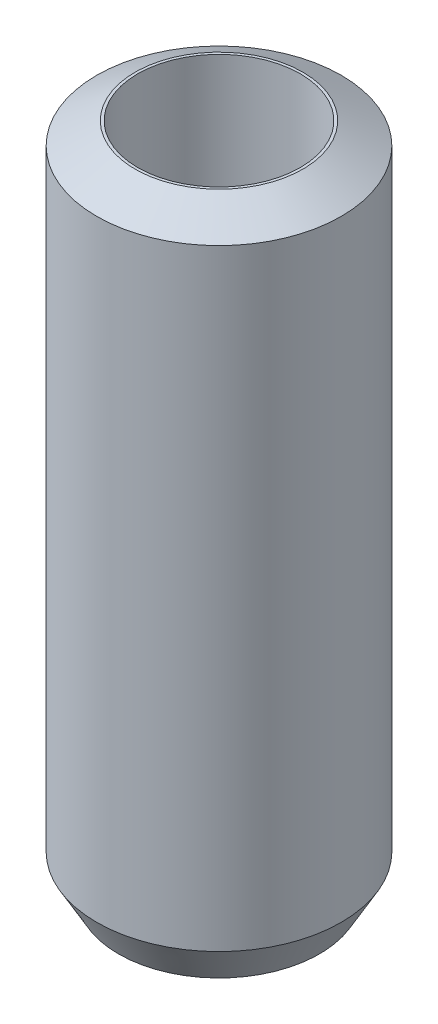
ISO-10303-21;
HEADER;
FILE_DESCRIPTION(('STEP AP214'),'2;1');
FILE_NAME('part.step','',(''),(''),'','','');
FILE_SCHEMA(('AUTOMOTIVE_DESIGN { 1 0 10303 214 1 1 1 1 }'));
ENDSEC;
DATA;
#1=APPLICATION_CONTEXT('core data for automotive mechanical design processes');
#2=APPLICATION_PROTOCOL_DEFINITION('international standard','automotive_design',2000,#1);
#3=PRODUCT_CONTEXT('',#1,'mechanical');
#4=PRODUCT('Part','Part','',(#3));
#5=PRODUCT_RELATED_PRODUCT_CATEGORY('part','',(#4));
#6=PRODUCT_DEFINITION_FORMATION('','',#4);
#7=PRODUCT_DEFINITION_CONTEXT('part definition',#1,'design');
#8=PRODUCT_DEFINITION('design','',#6,#7);
#9=PRODUCT_DEFINITION_SHAPE('','',#8);
#10=(LENGTH_UNIT() NAMED_UNIT(*) SI_UNIT(.MILLI.,.METRE.));
#11=(NAMED_UNIT(*) PLANE_ANGLE_UNIT() SI_UNIT($,.RADIAN.));
#12=(NAMED_UNIT(*) SI_UNIT($,.STERADIAN.) SOLID_ANGLE_UNIT());
#13=UNCERTAINTY_MEASURE_WITH_UNIT(LENGTH_MEASURE(1.E-05),#10,'distance_accuracy_value','');
#14=(GEOMETRIC_REPRESENTATION_CONTEXT(3) GLOBAL_UNCERTAINTY_ASSIGNED_CONTEXT((#13)) GLOBAL_UNIT_ASSIGNED_CONTEXT((#10,
#11,#12)) REPRESENTATION_CONTEXT('',''));
#15=CARTESIAN_POINT('',(0.,0.,0.));
#16=DIRECTION('',(0.,0.,1.));
#17=DIRECTION('',(1.,0.,0.));
#18=AXIS2_PLACEMENT_3D('',#15,#16,#17);
#19=CARTESIAN_POINT('',(0.,54.9265384111622,0.));
#20=DIRECTION('',(0.,-1.,0.));
#21=DIRECTION('',(0.,0.,-1.));
#22=AXIS2_PLACEMENT_3D('',#19,#20,#21);
#23=CYLINDRICAL_SURFACE('',#22,10.);
#24=CARTESIAN_POINT('',(0.,53.1459204550197,0.));
#25=DIRECTION('',(0.,1.,0.));
#26=DIRECTION('',(0.,0.,1.));
#27=AXIS2_PLACEMENT_3D('',#24,#25,#26);
#28=CIRCLE('',#27,10.);
#29=CARTESIAN_POINT('',(0.,53.1459204550197,-10.));
#30=VERTEX_POINT('',#29);
#31=EDGE_CURVE('E50',#30,#30,#28,.F.);
#32=ORIENTED_EDGE('',*,*,#31,.T.);
#33=EDGE_LOOP('',(#32));
#34=FACE_BOUND('',#33,.T.);
#35=CARTESIAN_POINT('',(0.,3.13112003538391,0.));
#36=DIRECTION('',(0.,1.,0.));
#37=DIRECTION('',(0.,0.,1.));
#38=AXIS2_PLACEMENT_3D('',#35,#36,#37);
#39=CIRCLE('',#38,10.);
#40=CARTESIAN_POINT('',(0.,3.13112003538391,10.));
#41=VERTEX_POINT('',#40);
#42=EDGE_CURVE('E51',#41,#41,#39,.T.);
#43=ORIENTED_EDGE('',*,*,#42,.T.);
#44=EDGE_LOOP('',(#43));
#45=FACE_BOUND('',#44,.T.);
#46=ADVANCED_FACE('F39',(#34,#45),#23,.T.);
#47=CARTESIAN_POINT('',(0.,54.9265384111622,0.));
#48=DIRECTION('',(0.,1.,0.));
#49=DIRECTION('',(0.,0.,1.));
#50=AXIS2_PLACEMENT_3D('',#47,#48,#49);
#51=PLANE('',#50);
#52=CARTESIAN_POINT('',(0.,54.9265384111622,0.));
#53=DIRECTION('',(0.,1.,0.));
#54=DIRECTION('',(0.,0.,1.));
#55=AXIS2_PLACEMENT_3D('',#52,#53,#54);
#56=CIRCLE('',#55,6.8688799646161);
#57=CARTESIAN_POINT('',(0.,54.9265384111622,-6.86887996461611));
#58=VERTEX_POINT('',#57);
#59=EDGE_CURVE('E54',#58,#58,#56,.T.);
#60=ORIENTED_EDGE('',*,*,#59,.T.);
#61=EDGE_LOOP('',(#60));
#62=FACE_BOUND('',#61,.T.);
#63=CARTESIAN_POINT('',(0.,54.9265384111622,0.));
#64=DIRECTION('',(0.,1.,0.));
#65=DIRECTION('',(0.,0.,1.));
#66=AXIS2_PLACEMENT_3D('',#63,#64,#65);
#67=CIRCLE('',#66,6.64897858950923);
#68=CARTESIAN_POINT('',(0.,54.9265384111622,6.64897858950923));
#69=VERTEX_POINT('',#68);
#70=EDGE_CURVE('E58',#69,#69,#67,.T.);
#71=ORIENTED_EDGE('',*,*,#70,.F.);
#72=EDGE_LOOP('',(#71));
#73=FACE_BOUND('',#72,.T.);
#74=ADVANCED_FACE('F69',(#62,#73),#51,.T.);
#75=CARTESIAN_POINT('',(0.,0.,0.));
#76=DIRECTION('',(0.,1.,0.));
#77=DIRECTION('',(0.,0.,1.));
#78=AXIS2_PLACEMENT_3D('',#75,#76,#77);
#79=PLANE('',#78);
#80=CARTESIAN_POINT('',(0.,0.,0.));
#81=DIRECTION('',(0.,1.,0.));
#82=DIRECTION('',(0.,0.,1.));
#83=AXIS2_PLACEMENT_3D('',#80,#81,#82);
#84=CIRCLE('',#83,8.21938204385746);
#85=CARTESIAN_POINT('',(0.,0.,8.21938204385746));
#86=VERTEX_POINT('',#85);
#87=EDGE_CURVE('E10',#86,#86,#84,.F.);
#88=ORIENTED_EDGE('',*,*,#87,.T.);
#89=EDGE_LOOP('',(#88));
#90=FACE_BOUND('',#89,.T.);
#91=CARTESIAN_POINT('',(0.,0.,0.));
#92=DIRECTION('',(0.,1.,0.));
#93=DIRECTION('',(0.,0.,1.));
#94=AXIS2_PLACEMENT_3D('',#91,#92,#93);
#95=CIRCLE('',#94,6.64897858950923);
#96=CARTESIAN_POINT('',(0.,0.,6.64897858950923));
#97=VERTEX_POINT('',#96);
#98=EDGE_CURVE('E63',#97,#97,#95,.T.);
#99=ORIENTED_EDGE('',*,*,#98,.T.);
#100=EDGE_LOOP('',(#99));
#101=FACE_BOUND('',#100,.T.);
#102=ADVANCED_FACE('F75',(#90,#101),#79,.F.);
#103=CARTESIAN_POINT('',(0.,54.9265384111622,0.));
#104=DIRECTION('',(0.,-1.,0.));
#105=DIRECTION('',(0.,0.,-1.));
#106=AXIS2_PLACEMENT_3D('',#103,#104,#105);
#107=CYLINDRICAL_SURFACE('',#106,6.64897858950923);
#108=ORIENTED_EDGE('',*,*,#70,.T.);
#109=EDGE_LOOP('',(#108));
#110=FACE_BOUND('',#109,.T.);
#111=ORIENTED_EDGE('',*,*,#98,.F.);
#112=EDGE_LOOP('',(#111));
#113=FACE_BOUND('',#112,.T.);
#114=ADVANCED_FACE('F70',(#110,#113),#107,.F.);
#115=CARTESIAN_POINT('',(0.,54.9265384111622,0.));
#116=DIRECTION('',(0.,-1.,0.));
#117=DIRECTION('',(0.,0.,-1.));
#118=AXIS2_PLACEMENT_3D('',#115,#116,#117);
#119=CONICAL_SURFACE('',#118,6.8688799646161,1.05372162150405);
#120=CARTESIAN_POINT('',(0.,53.1459204550197,-10.));
#121=CARTESIAN_POINT('',(0.,53.1644685587295,-9.96738416629809));
#122=CARTESIAN_POINT('',(0.,53.1830166624393,-9.93476833259617));
#123=CARTESIAN_POINT('',(0.,53.220112869859,-9.86953666519234));
#124=CARTESIAN_POINT('',(0.,53.2386609735688,-9.83692083149043));
#125=CARTESIAN_POINT('',(0.,53.2757571809884,-9.7716891640866));
#126=CARTESIAN_POINT('',(0.,53.2943052846983,-9.73907333038468));
#127=CARTESIAN_POINT('',(0.,53.3314014921179,-9.67384166298085));
#128=CARTESIAN_POINT('',(0.,53.3499495958277,-9.64122582927893));
#129=CARTESIAN_POINT('',(0.,53.3870458032473,-9.5759941618751));
#130=CARTESIAN_POINT('',(0.,53.4055939069572,-9.54337832817319));
#131=CARTESIAN_POINT('',(0.,53.4426901143768,-9.47814666076936));
#132=CARTESIAN_POINT('',(0.,53.4612382180866,-9.44553082706744));
#133=CARTESIAN_POINT('',(0.,53.4983344255063,-9.38029915966361));
#134=CARTESIAN_POINT('',(0.,53.5168825292161,-9.3476833259617));
#135=CARTESIAN_POINT('',(0.,53.5539787366357,-9.28245165855786));
#136=CARTESIAN_POINT('',(0.,53.5725268403455,-9.24983582485595));
#137=CARTESIAN_POINT('',(0.,53.6096230477652,-9.18460415745212));
#138=CARTESIAN_POINT('',(0.,53.628171151475,-9.1519883237502));
#139=CARTESIAN_POINT('',(0.,53.6652673588946,-9.08675665634637));
#140=CARTESIAN_POINT('',(0.,53.6838154626044,-9.05414082264445));
#141=CARTESIAN_POINT('',(0.,53.7209116700241,-8.98890915524062));
#142=CARTESIAN_POINT('',(0.,53.7394597737339,-8.95629332153871));
#143=CARTESIAN_POINT('',(0.,53.7765559811535,-8.89106165413487));
#144=CARTESIAN_POINT('',(0.,53.7951040848633,-8.85844582043296));
#145=CARTESIAN_POINT('',(0.,53.832200292283,-8.79321415302913));
#146=CARTESIAN_POINT('',(0.,53.8507483959928,-8.76059831932721));
#147=CARTESIAN_POINT('',(0.,53.8878446034124,-8.69536665192338));
#148=CARTESIAN_POINT('',(0.,53.9063927071222,-8.66275081822147));
#149=CARTESIAN_POINT('',(0.,53.9434889145419,-8.59751915081764));
#150=CARTESIAN_POINT('',(0.,53.9620370182517,-8.56490331711572));
#151=CARTESIAN_POINT('',(0.,53.9991332256713,-8.49967164971189));
#152=CARTESIAN_POINT('',(0.,54.0176813293812,-8.46705581600997));
#153=CARTESIAN_POINT('',(0.,54.0547775368008,-8.40182414860614));
#154=CARTESIAN_POINT('',(0.,54.0733256405106,-8.36920831490423));
#155=CARTESIAN_POINT('',(0.,54.1104218479302,-8.3039766475004));
#156=CARTESIAN_POINT('',(0.,54.1289699516401,-8.27136081379848));
#157=CARTESIAN_POINT('',(0.,54.1660661590597,-8.20612914639465));
#158=CARTESIAN_POINT('',(0.,54.1846142627695,-8.17351331269273));
#159=CARTESIAN_POINT('',(0.,54.2217104701892,-8.1082816452889));
#160=CARTESIAN_POINT('',(0.,54.240258573899,-8.07566581158699));
#161=CARTESIAN_POINT('',(0.,54.2773547813186,-8.01043414418316));
#162=CARTESIAN_POINT('',(0.,54.2959028850284,-7.97781831048124));
#163=CARTESIAN_POINT('',(0.,54.3329990924481,-7.91258664307741));
#164=CARTESIAN_POINT('',(0.,54.3515471961579,-7.87997080937549));
#165=CARTESIAN_POINT('',(0.,54.3886434035775,-7.81473914197166));
#166=CARTESIAN_POINT('',(0.,54.4071915072873,-7.78212330826975));
#167=CARTESIAN_POINT('',(0.,54.444287714707,-7.71689164086592));
#168=CARTESIAN_POINT('',(0.,54.4628358184168,-7.684275807164));
#169=CARTESIAN_POINT('',(0.,54.4999320258364,-7.61904413976017));
#170=CARTESIAN_POINT('',(0.,54.5184801295462,-7.58642830605825));
#171=CARTESIAN_POINT('',(0.,54.5555763369659,-7.52119663865442));
#172=CARTESIAN_POINT('',(0.,54.5741244406757,-7.48858080495251));
#173=CARTESIAN_POINT('',(0.,54.6112206480953,-7.42334913754867));
#174=CARTESIAN_POINT('',(0.,54.6297687518051,-7.39073330384676));
#175=CARTESIAN_POINT('',(0.,54.6668649592248,-7.32550163644293));
#176=CARTESIAN_POINT('',(0.,54.6854130629346,-7.29288580274101));
#177=CARTESIAN_POINT('',(0.,54.7225092703542,-7.22765413533718));
#178=CARTESIAN_POINT('',(0.,54.7410573740641,-7.19503830163527));
#179=CARTESIAN_POINT('',(0.,54.7781535814837,-7.12980663423143));
#180=CARTESIAN_POINT('',(0.,54.7967016851935,-7.09719080052952));
#181=CARTESIAN_POINT('',(0.,54.8337978926131,-7.03195913312569));
#182=CARTESIAN_POINT('',(0.,54.852345996323,-6.99934329942377));
#183=CARTESIAN_POINT('',(0.,54.8894422037426,-6.93411163201994));
#184=CARTESIAN_POINT('',(0.,54.9079903074524,-6.90149579831802));
#185=CARTESIAN_POINT('',(0.,54.9265384111622,-6.86887996461611));
#186=B_SPLINE_CURVE_WITH_KNOTS('',3,(#120,#121,#122,#123,#124,#125,#126,#127,#128,#129,#130,
#131,#132,#133,#134,#135,#136,#137,#138,#139,#140,#141,#142,#143,#144,#145,#146,#147,#148,#149,
#150,#151,#152,#153,#154,#155,#156,#157,#158,#159,#160,#161,#162,#163,#164,#165,#166,#167,#168,
#169,#170,#171,#172,#173,#174,#175,#176,#177,#178,#179,#180,#181,#182,#183,#184,#185),
.UNSPECIFIED.,.F.,.F.,(4,2,2,2,2,2,2,2,2,2,2,2,2,2,2,2,2,2,2,2,2,2,2,2,2,2,2,2,2,2,2,2,4),(0.,
0.112562972747302,0.225125945494608,0.337688918241915,0.450251890989218,0.562814863736524,
0.675377836483829,0.787940809231136,0.900503781978439,1.01306675472575,1.12562972747305,
1.23819270022036,1.35075567296766,1.46331864571497,1.57588161846227,1.68844459120958,
1.80100756395688,1.91357053670419,2.02613350945149,2.1386964821988,2.2512594549461,
2.36382242769341,2.47638540044071,2.58894837318802,2.70151134593533,2.81407431868263,
2.92663729142994,3.03920026417724,3.15176323692455,3.26432620967185,3.37688918241916,
3.48945215516646,3.60201512791377),.UNSPECIFIED.);
#187=EDGE_CURVE('BSEAM81',#30,#58,#186,.T.);
#188=ORIENTED_EDGE('',*,*,#31,.F.);
#189=ORIENTED_EDGE('',*,*,#59,.F.);
#190=ORIENTED_EDGE('',*,*,#187,.T.);
#191=ORIENTED_EDGE('',*,*,#187,.F.);
#192=EDGE_LOOP('',(#188,#190,#189,#191));
#193=FACE_BOUND('',#192,.T.);
#194=ADVANCED_FACE('F81',(#193),#119,.T.);
#195=CARTESIAN_POINT('',(0.,3.13112003538391,0.));
#196=DIRECTION('',(0.,1.,0.));
#197=DIRECTION('',(0.,0.,1.));
#198=AXIS2_PLACEMENT_3D('',#195,#196,#197);
#199=CONICAL_SURFACE('',#198,10.,0.517074705290842);
#200=ORIENTED_EDGE('',*,*,#87,.F.);
#201=EDGE_LOOP('',(#200));
#202=FACE_BOUND('',#201,.T.);
#203=ORIENTED_EDGE('',*,*,#42,.F.);
#204=EDGE_LOOP('',(#203));
#205=FACE_BOUND('',#204,.T.);
#206=ADVANCED_FACE('F45',(#202,#205),#199,.T.);
#207=CLOSED_SHELL('',(#46,#74,#102,#114,#194,#206));
#208=MANIFOLD_SOLID_BREP('B2',#207);
#209=ADVANCED_BREP_SHAPE_REPRESENTATION('',(#18,#208),#14);
#210=SHAPE_DEFINITION_REPRESENTATION(#9,#209);
ENDSEC;
END-ISO-10303-21;
